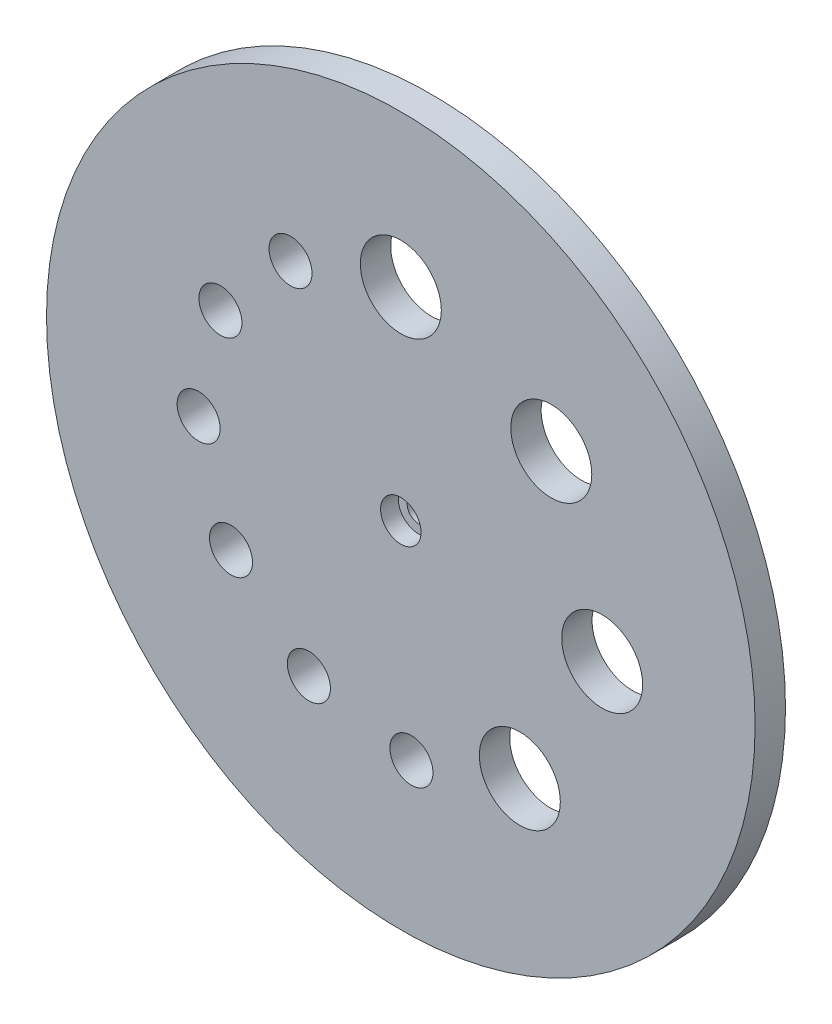
ISO-10303-21;
HEADER;
FILE_DESCRIPTION(('STEP AP214'),'2;1');
FILE_NAME('part.step','',(''),(''),'','','');
FILE_SCHEMA(('AUTOMOTIVE_DESIGN { 1 0 10303 214 1 1 1 1 }'));
ENDSEC;
DATA;
#1=APPLICATION_CONTEXT('core data for automotive mechanical design processes');
#2=APPLICATION_PROTOCOL_DEFINITION('international standard','automotive_design',2000,#1);
#3=PRODUCT_CONTEXT('',#1,'mechanical');
#4=PRODUCT('Part','Part','',(#3));
#5=PRODUCT_RELATED_PRODUCT_CATEGORY('part','',(#4));
#6=PRODUCT_DEFINITION_FORMATION('','',#4);
#7=PRODUCT_DEFINITION_CONTEXT('part definition',#1,'design');
#8=PRODUCT_DEFINITION('design','',#6,#7);
#9=PRODUCT_DEFINITION_SHAPE('','',#8);
#10=(LENGTH_UNIT() NAMED_UNIT(*) SI_UNIT(.MILLI.,.METRE.));
#11=(NAMED_UNIT(*) PLANE_ANGLE_UNIT() SI_UNIT($,.RADIAN.));
#12=(NAMED_UNIT(*) SI_UNIT($,.STERADIAN.) SOLID_ANGLE_UNIT());
#13=UNCERTAINTY_MEASURE_WITH_UNIT(LENGTH_MEASURE(1.E-05),#10,'distance_accuracy_value','');
#14=(GEOMETRIC_REPRESENTATION_CONTEXT(3) GLOBAL_UNCERTAINTY_ASSIGNED_CONTEXT((#13)) GLOBAL_UNIT_ASSIGNED_CONTEXT((#10,
#11,#12)) REPRESENTATION_CONTEXT('',''));
#15=CARTESIAN_POINT('',(0.,0.,0.));
#16=DIRECTION('',(0.,0.,1.));
#17=DIRECTION('',(1.,0.,0.));
#18=AXIS2_PLACEMENT_3D('',#15,#16,#17);
#19=CARTESIAN_POINT('',(0.,0.,12.));
#20=DIRECTION('',(0.,0.,-1.));
#21=DIRECTION('',(-1.,0.,0.));
#22=AXIS2_PLACEMENT_3D('',#19,#20,#21);
#23=CYLINDRICAL_SURFACE('',#22,140.);
#24=CARTESIAN_POINT('',(0.,0.,12.));
#25=DIRECTION('',(0.,0.,1.));
#26=DIRECTION('',(1.,0.,0.));
#27=AXIS2_PLACEMENT_3D('',#24,#25,#26);
#28=CIRCLE('',#27,140.);
#29=CARTESIAN_POINT('',(140.,0.,12.));
#30=VERTEX_POINT('',#29);
#31=EDGE_CURVE('E10',#30,#30,#28,.T.);
#32=ORIENTED_EDGE('',*,*,#31,.F.);
#33=EDGE_LOOP('',(#32));
#34=FACE_BOUND('',#33,.T.);
#35=CARTESIAN_POINT('',(0.,0.,0.));
#36=DIRECTION('',(0.,0.,1.));
#37=DIRECTION('',(1.,0.,0.));
#38=AXIS2_PLACEMENT_3D('',#35,#36,#37);
#39=CIRCLE('',#38,140.);
#40=CARTESIAN_POINT('',(140.,0.,0.));
#41=VERTEX_POINT('',#40);
#42=EDGE_CURVE('E32',#41,#41,#39,.T.);
#43=ORIENTED_EDGE('',*,*,#42,.T.);
#44=EDGE_LOOP('',(#43));
#45=FACE_BOUND('',#44,.T.);
#46=ADVANCED_FACE('F29',(#34,#45),#23,.T.);
#47=CARTESIAN_POINT('',(0.,0.,12.));
#48=DIRECTION('',(0.,0.,1.));
#49=DIRECTION('',(1.,0.,0.));
#50=AXIS2_PLACEMENT_3D('',#47,#48,#49);
#51=PLANE('',#50);
#52=CARTESIAN_POINT('',(0.,0.,12.));
#53=DIRECTION('',(0.,0.,1.));
#54=DIRECTION('',(1.,0.,0.));
#55=AXIS2_PLACEMENT_3D('',#52,#53,#54);
#56=CIRCLE('',#55,8.);
#57=CARTESIAN_POINT('',(8.,0.,12.));
#58=VERTEX_POINT('',#57);
#59=EDGE_CURVE('E109',#58,#58,#56,.T.);
#60=ORIENTED_EDGE('',*,*,#59,.F.);
#61=EDGE_LOOP('',(#60));
#62=FACE_BOUND('',#61,.T.);
#63=CARTESIAN_POINT('',(-43.5711228012014,67.0936454356344,12.));
#64=DIRECTION('',(0.,0.,1.));
#65=DIRECTION('',(1.,0.,0.));
#66=AXIS2_PLACEMENT_3D('',#63,#64,#65);
#67=CIRCLE('',#66,8.50000000000001);
#68=CARTESIAN_POINT('',(-35.0711228012014,67.0936454356344,12.));
#69=VERTEX_POINT('',#68);
#70=EDGE_CURVE('E95',#69,#69,#67,.T.);
#71=ORIENTED_EDGE('',*,*,#70,.F.);
#72=EDGE_LOOP('',(#71));
#73=FACE_BOUND('',#72,.T.);
#74=CARTESIAN_POINT('',(-71.280521935069,36.3192399791645,12.));
#75=DIRECTION('',(0.,0.,1.));
#76=DIRECTION('',(1.,0.,0.));
#77=AXIS2_PLACEMENT_3D('',#74,#75,#76);
#78=CIRCLE('',#77,8.50000000000001);
#79=CARTESIAN_POINT('',(-62.780521935069,36.3192399791645,12.));
#80=VERTEX_POINT('',#79);
#81=EDGE_CURVE('E89',#80,#80,#78,.T.);
#82=ORIENTED_EDGE('',*,*,#81,.F.);
#83=EDGE_LOOP('',(#82));
#84=FACE_BOUND('',#83,.T.);
#85=CARTESIAN_POINT('',(-79.8903627803659,-4.18687649943474,12.));
#86=DIRECTION('',(0.,0.,1.));
#87=DIRECTION('',(1.,0.,0.));
#88=AXIS2_PLACEMENT_3D('',#85,#86,#87);
#89=CIRCLE('',#88,8.50000000000001);
#90=CARTESIAN_POINT('',(-71.3903627803659,-4.18687649943474,12.));
#91=VERTEX_POINT('',#90);
#92=EDGE_CURVE('E83',#91,#91,#89,.T.);
#93=ORIENTED_EDGE('',*,*,#92,.F.);
#94=EDGE_LOOP('',(#93));
#95=FACE_BOUND('',#94,.T.);
#96=CARTESIAN_POINT('',(-67.0936454356343,-43.5711228012016,12.));
#97=DIRECTION('',(0.,0.,1.));
#98=DIRECTION('',(1.,0.,0.));
#99=AXIS2_PLACEMENT_3D('',#96,#97,#98);
#100=CIRCLE('',#99,8.5);
#101=CARTESIAN_POINT('',(-58.5936454356343,-43.5711228012016,12.));
#102=VERTEX_POINT('',#101);
#103=EDGE_CURVE('E77',#102,#102,#100,.T.);
#104=ORIENTED_EDGE('',*,*,#103,.F.);
#105=EDGE_LOOP('',(#104));
#106=FACE_BOUND('',#105,.T.);
#107=CARTESIAN_POINT('',(-36.3192399791643,-71.2805219350692,12.));
#108=DIRECTION('',(0.,0.,1.));
#109=DIRECTION('',(1.,0.,0.));
#110=AXIS2_PLACEMENT_3D('',#107,#108,#109);
#111=CIRCLE('',#110,8.50000000000001);
#112=CARTESIAN_POINT('',(-27.8192399791642,-71.2805219350692,12.));
#113=VERTEX_POINT('',#112);
#114=EDGE_CURVE('E71',#113,#113,#111,.T.);
#115=ORIENTED_EDGE('',*,*,#114,.F.);
#116=EDGE_LOOP('',(#115));
#117=FACE_BOUND('',#116,.T.);
#118=CARTESIAN_POINT('',(47.0228201833975,-64.7213595499961,12.));
#119=DIRECTION('',(0.,0.,1.));
#120=DIRECTION('',(1.,0.,0.));
#121=AXIS2_PLACEMENT_3D('',#118,#119,#120);
#122=CIRCLE('',#121,16.);
#123=CARTESIAN_POINT('',(63.0228201833975,-64.7213595499961,12.));
#124=VERTEX_POINT('',#123);
#125=EDGE_CURVE('E65',#124,#124,#122,.T.);
#126=ORIENTED_EDGE('',*,*,#125,.F.);
#127=EDGE_LOOP('',(#126));
#128=FACE_BOUND('',#127,.T.);
#129=CARTESIAN_POINT('',(79.5617516294619,-8.36227706141259,12.));
#130=DIRECTION('',(0.,0.,1.));
#131=DIRECTION('',(1.,0.,0.));
#132=AXIS2_PLACEMENT_3D('',#129,#130,#131);
#133=CIRCLE('',#132,16.);
#134=CARTESIAN_POINT('',(95.5617516294619,-8.36227706141259,12.));
#135=VERTEX_POINT('',#134);
#136=EDGE_CURVE('E59',#135,#135,#133,.T.);
#137=ORIENTED_EDGE('',*,*,#136,.F.);
#138=EDGE_LOOP('',(#137));
#139=FACE_BOUND('',#138,.T.);
#140=CARTESIAN_POINT('',(4.18687649943502,-79.8903627803659,12.));
#141=DIRECTION('',(0.,0.,1.));
#142=DIRECTION('',(1.,0.,0.));
#143=AXIS2_PLACEMENT_3D('',#140,#141,#142);
#144=CIRCLE('',#143,8.5);
#145=CARTESIAN_POINT('',(12.686876499435,-79.8903627803659,12.));
#146=VERTEX_POINT('',#145);
#147=EDGE_CURVE('E53',#146,#146,#144,.T.);
#148=ORIENTED_EDGE('',*,*,#147,.F.);
#149=EDGE_LOOP('',(#148));
#150=FACE_BOUND('',#149,.T.);
#151=CARTESIAN_POINT('',(0.,80.,12.));
#152=DIRECTION('',(0.,0.,1.));
#153=DIRECTION('',(1.,0.,0.));
#154=AXIS2_PLACEMENT_3D('',#151,#152,#153);
#155=CIRCLE('',#154,16.);
#156=CARTESIAN_POINT('',(16.,80.,12.));
#157=VERTEX_POINT('',#156);
#158=EDGE_CURVE('E47',#157,#157,#155,.T.);
#159=ORIENTED_EDGE('',*,*,#158,.F.);
#160=EDGE_LOOP('',(#159));
#161=FACE_BOUND('',#160,.T.);
#162=CARTESIAN_POINT('',(59.4515860381916,53.5304485087086,12.));
#163=DIRECTION('',(0.,0.,1.));
#164=DIRECTION('',(1.,0.,0.));
#165=AXIS2_PLACEMENT_3D('',#162,#163,#164);
#166=CIRCLE('',#165,16.);
#167=CARTESIAN_POINT('',(75.4515860381916,53.5304485087086,12.));
#168=VERTEX_POINT('',#167);
#169=EDGE_CURVE('E41',#168,#168,#166,.T.);
#170=ORIENTED_EDGE('',*,*,#169,.F.);
#171=EDGE_LOOP('',(#170));
#172=FACE_BOUND('',#171,.T.);
#173=ORIENTED_EDGE('',*,*,#31,.T.);
#174=EDGE_LOOP('',(#173));
#175=FACE_BOUND('',#174,.T.);
#176=ADVANCED_FACE('F115',(#62,#73,#84,#95,#106,#117,#128,#139,#150,#161,#172,#175),#51,.T.);
#177=CARTESIAN_POINT('',(0.,0.,0.));
#178=DIRECTION('',(0.,0.,1.));
#179=DIRECTION('',(1.,0.,0.));
#180=AXIS2_PLACEMENT_3D('',#177,#178,#179);
#181=PLANE('',#180);
#182=CARTESIAN_POINT('',(0.,0.,0.));
#183=DIRECTION('',(0.,0.,1.));
#184=DIRECTION('',(1.,0.,0.));
#185=AXIS2_PLACEMENT_3D('',#182,#183,#184);
#186=CIRCLE('',#185,4.5);
#187=CARTESIAN_POINT('',(4.5,0.,0.));
#188=VERTEX_POINT('',#187);
#189=EDGE_CURVE('E98',#188,#188,#186,.T.);
#190=ORIENTED_EDGE('',*,*,#189,.T.);
#191=EDGE_LOOP('',(#190));
#192=FACE_BOUND('',#191,.T.);
#193=CARTESIAN_POINT('',(-43.5711228012014,67.0936454356344,0.));
#194=DIRECTION('',(0.,0.,1.));
#195=DIRECTION('',(1.,0.,0.));
#196=AXIS2_PLACEMENT_3D('',#193,#194,#195);
#197=CIRCLE('',#196,8.50000000000001);
#198=CARTESIAN_POINT('',(-35.0711228012014,67.0936454356344,0.));
#199=VERTEX_POINT('',#198);
#200=EDGE_CURVE('E92',#199,#199,#197,.T.);
#201=ORIENTED_EDGE('',*,*,#200,.T.);
#202=EDGE_LOOP('',(#201));
#203=FACE_BOUND('',#202,.T.);
#204=CARTESIAN_POINT('',(-71.280521935069,36.3192399791645,0.));
#205=DIRECTION('',(0.,0.,1.));
#206=DIRECTION('',(1.,0.,0.));
#207=AXIS2_PLACEMENT_3D('',#204,#205,#206);
#208=CIRCLE('',#207,8.50000000000001);
#209=CARTESIAN_POINT('',(-62.780521935069,36.3192399791645,0.));
#210=VERTEX_POINT('',#209);
#211=EDGE_CURVE('E86',#210,#210,#208,.T.);
#212=ORIENTED_EDGE('',*,*,#211,.T.);
#213=EDGE_LOOP('',(#212));
#214=FACE_BOUND('',#213,.T.);
#215=CARTESIAN_POINT('',(-79.8903627803659,-4.18687649943474,0.));
#216=DIRECTION('',(0.,0.,1.));
#217=DIRECTION('',(1.,0.,0.));
#218=AXIS2_PLACEMENT_3D('',#215,#216,#217);
#219=CIRCLE('',#218,8.50000000000001);
#220=CARTESIAN_POINT('',(-71.3903627803659,-4.18687649943474,0.));
#221=VERTEX_POINT('',#220);
#222=EDGE_CURVE('E80',#221,#221,#219,.T.);
#223=ORIENTED_EDGE('',*,*,#222,.T.);
#224=EDGE_LOOP('',(#223));
#225=FACE_BOUND('',#224,.T.);
#226=CARTESIAN_POINT('',(-67.0936454356343,-43.5711228012016,0.));
#227=DIRECTION('',(0.,0.,1.));
#228=DIRECTION('',(1.,0.,0.));
#229=AXIS2_PLACEMENT_3D('',#226,#227,#228);
#230=CIRCLE('',#229,8.5);
#231=CARTESIAN_POINT('',(-58.5936454356343,-43.5711228012016,0.));
#232=VERTEX_POINT('',#231);
#233=EDGE_CURVE('E74',#232,#232,#230,.T.);
#234=ORIENTED_EDGE('',*,*,#233,.T.);
#235=EDGE_LOOP('',(#234));
#236=FACE_BOUND('',#235,.T.);
#237=CARTESIAN_POINT('',(-36.3192399791643,-71.2805219350692,0.));
#238=DIRECTION('',(0.,0.,1.));
#239=DIRECTION('',(1.,0.,0.));
#240=AXIS2_PLACEMENT_3D('',#237,#238,#239);
#241=CIRCLE('',#240,8.50000000000001);
#242=CARTESIAN_POINT('',(-27.8192399791642,-71.2805219350692,0.));
#243=VERTEX_POINT('',#242);
#244=EDGE_CURVE('E68',#243,#243,#241,.T.);
#245=ORIENTED_EDGE('',*,*,#244,.T.);
#246=EDGE_LOOP('',(#245));
#247=FACE_BOUND('',#246,.T.);
#248=CARTESIAN_POINT('',(47.0228201833975,-64.7213595499961,0.));
#249=DIRECTION('',(0.,0.,1.));
#250=DIRECTION('',(1.,0.,0.));
#251=AXIS2_PLACEMENT_3D('',#248,#249,#250);
#252=CIRCLE('',#251,16.);
#253=CARTESIAN_POINT('',(63.0228201833975,-64.7213595499961,0.));
#254=VERTEX_POINT('',#253);
#255=EDGE_CURVE('E62',#254,#254,#252,.T.);
#256=ORIENTED_EDGE('',*,*,#255,.T.);
#257=EDGE_LOOP('',(#256));
#258=FACE_BOUND('',#257,.T.);
#259=CARTESIAN_POINT('',(79.5617516294619,-8.36227706141259,0.));
#260=DIRECTION('',(0.,0.,1.));
#261=DIRECTION('',(1.,0.,0.));
#262=AXIS2_PLACEMENT_3D('',#259,#260,#261);
#263=CIRCLE('',#262,16.);
#264=CARTESIAN_POINT('',(95.5617516294619,-8.36227706141259,0.));
#265=VERTEX_POINT('',#264);
#266=EDGE_CURVE('E56',#265,#265,#263,.T.);
#267=ORIENTED_EDGE('',*,*,#266,.T.);
#268=EDGE_LOOP('',(#267));
#269=FACE_BOUND('',#268,.T.);
#270=CARTESIAN_POINT('',(4.18687649943502,-79.8903627803659,0.));
#271=DIRECTION('',(0.,0.,1.));
#272=DIRECTION('',(1.,0.,0.));
#273=AXIS2_PLACEMENT_3D('',#270,#271,#272);
#274=CIRCLE('',#273,8.5);
#275=CARTESIAN_POINT('',(12.686876499435,-79.8903627803659,0.));
#276=VERTEX_POINT('',#275);
#277=EDGE_CURVE('E50',#276,#276,#274,.T.);
#278=ORIENTED_EDGE('',*,*,#277,.T.);
#279=EDGE_LOOP('',(#278));
#280=FACE_BOUND('',#279,.T.);
#281=CARTESIAN_POINT('',(0.,80.,0.));
#282=DIRECTION('',(0.,0.,1.));
#283=DIRECTION('',(1.,0.,0.));
#284=AXIS2_PLACEMENT_3D('',#281,#282,#283);
#285=CIRCLE('',#284,16.);
#286=CARTESIAN_POINT('',(16.,80.,0.));
#287=VERTEX_POINT('',#286);
#288=EDGE_CURVE('E44',#287,#287,#285,.T.);
#289=ORIENTED_EDGE('',*,*,#288,.T.);
#290=EDGE_LOOP('',(#289));
#291=FACE_BOUND('',#290,.T.);
#292=CARTESIAN_POINT('',(59.4515860381916,53.5304485087086,0.));
#293=DIRECTION('',(0.,0.,1.));
#294=DIRECTION('',(1.,0.,0.));
#295=AXIS2_PLACEMENT_3D('',#292,#293,#294);
#296=CIRCLE('',#295,16.);
#297=CARTESIAN_POINT('',(75.4515860381916,53.5304485087086,0.));
#298=VERTEX_POINT('',#297);
#299=EDGE_CURVE('E39',#298,#298,#296,.T.);
#300=ORIENTED_EDGE('',*,*,#299,.T.);
#301=EDGE_LOOP('',(#300));
#302=FACE_BOUND('',#301,.T.);
#303=ORIENTED_EDGE('',*,*,#42,.F.);
#304=EDGE_LOOP('',(#303));
#305=FACE_BOUND('',#304,.T.);
#306=ADVANCED_FACE('F118',(#192,#203,#214,#225,#236,#247,#258,#269,#280,#291,#302,#305),#181,.F.);
#307=CARTESIAN_POINT('',(59.4515860381916,53.5304485087086,0.));
#308=DIRECTION('',(0.,0.,1.));
#309=DIRECTION('',(1.,0.,0.));
#310=AXIS2_PLACEMENT_3D('',#307,#308,#309);
#311=CYLINDRICAL_SURFACE('',#310,16.);
#312=ORIENTED_EDGE('',*,*,#299,.F.);
#313=EDGE_LOOP('',(#312));
#314=FACE_BOUND('',#313,.T.);
#315=ORIENTED_EDGE('',*,*,#169,.T.);
#316=EDGE_LOOP('',(#315));
#317=FACE_BOUND('',#316,.T.);
#318=ADVANCED_FACE('F140',(#314,#317),#311,.F.);
#319=CARTESIAN_POINT('',(0.,80.,0.));
#320=DIRECTION('',(0.,0.,1.));
#321=DIRECTION('',(1.,0.,0.));
#322=AXIS2_PLACEMENT_3D('',#319,#320,#321);
#323=CYLINDRICAL_SURFACE('',#322,16.);
#324=ORIENTED_EDGE('',*,*,#288,.F.);
#325=EDGE_LOOP('',(#324));
#326=FACE_BOUND('',#325,.T.);
#327=ORIENTED_EDGE('',*,*,#158,.T.);
#328=EDGE_LOOP('',(#327));
#329=FACE_BOUND('',#328,.T.);
#330=ADVANCED_FACE('F142',(#326,#329),#323,.F.);
#331=CARTESIAN_POINT('',(4.18687649943502,-79.8903627803659,0.));
#332=DIRECTION('',(0.,0.,1.));
#333=DIRECTION('',(1.,0.,0.));
#334=AXIS2_PLACEMENT_3D('',#331,#332,#333);
#335=CYLINDRICAL_SURFACE('',#334,8.5);
#336=ORIENTED_EDGE('',*,*,#277,.F.);
#337=EDGE_LOOP('',(#336));
#338=FACE_BOUND('',#337,.T.);
#339=ORIENTED_EDGE('',*,*,#147,.T.);
#340=EDGE_LOOP('',(#339));
#341=FACE_BOUND('',#340,.T.);
#342=ADVANCED_FACE('F149',(#338,#341),#335,.F.);
#343=CARTESIAN_POINT('',(79.5617516294619,-8.36227706141259,0.));
#344=DIRECTION('',(0.,0.,1.));
#345=DIRECTION('',(1.,0.,0.));
#346=AXIS2_PLACEMENT_3D('',#343,#344,#345);
#347=CYLINDRICAL_SURFACE('',#346,16.);
#348=ORIENTED_EDGE('',*,*,#266,.F.);
#349=EDGE_LOOP('',(#348));
#350=FACE_BOUND('',#349,.T.);
#351=ORIENTED_EDGE('',*,*,#136,.T.);
#352=EDGE_LOOP('',(#351));
#353=FACE_BOUND('',#352,.T.);
#354=ADVANCED_FACE('F230',(#350,#353),#347,.F.);
#355=CARTESIAN_POINT('',(47.0228201833975,-64.7213595499961,0.));
#356=DIRECTION('',(0.,0.,1.));
#357=DIRECTION('',(1.,0.,0.));
#358=AXIS2_PLACEMENT_3D('',#355,#356,#357);
#359=CYLINDRICAL_SURFACE('',#358,16.);
#360=ORIENTED_EDGE('',*,*,#255,.F.);
#361=EDGE_LOOP('',(#360));
#362=FACE_BOUND('',#361,.T.);
#363=ORIENTED_EDGE('',*,*,#125,.T.);
#364=EDGE_LOOP('',(#363));
#365=FACE_BOUND('',#364,.T.);
#366=ADVANCED_FACE('F226',(#362,#365),#359,.F.);
#367=CARTESIAN_POINT('',(-36.3192399791643,-71.2805219350692,0.));
#368=DIRECTION('',(0.,0.,1.));
#369=DIRECTION('',(1.,0.,0.));
#370=AXIS2_PLACEMENT_3D('',#367,#368,#369);
#371=CYLINDRICAL_SURFACE('',#370,8.50000000000001);
#372=ORIENTED_EDGE('',*,*,#244,.F.);
#373=EDGE_LOOP('',(#372));
#374=FACE_BOUND('',#373,.T.);
#375=ORIENTED_EDGE('',*,*,#114,.T.);
#376=EDGE_LOOP('',(#375));
#377=FACE_BOUND('',#376,.T.);
#378=ADVANCED_FACE('F222',(#374,#377),#371,.F.);
#379=CARTESIAN_POINT('',(-67.0936454356343,-43.5711228012016,0.));
#380=DIRECTION('',(0.,0.,1.));
#381=DIRECTION('',(1.,0.,0.));
#382=AXIS2_PLACEMENT_3D('',#379,#380,#381);
#383=CYLINDRICAL_SURFACE('',#382,8.5);
#384=ORIENTED_EDGE('',*,*,#233,.F.);
#385=EDGE_LOOP('',(#384));
#386=FACE_BOUND('',#385,.T.);
#387=ORIENTED_EDGE('',*,*,#103,.T.);
#388=EDGE_LOOP('',(#387));
#389=FACE_BOUND('',#388,.T.);
#390=ADVANCED_FACE('F218',(#386,#389),#383,.F.);
#391=CARTESIAN_POINT('',(-79.8903627803659,-4.18687649943474,0.));
#392=DIRECTION('',(0.,0.,1.));
#393=DIRECTION('',(1.,0.,0.));
#394=AXIS2_PLACEMENT_3D('',#391,#392,#393);
#395=CYLINDRICAL_SURFACE('',#394,8.50000000000001);
#396=ORIENTED_EDGE('',*,*,#222,.F.);
#397=EDGE_LOOP('',(#396));
#398=FACE_BOUND('',#397,.T.);
#399=ORIENTED_EDGE('',*,*,#92,.T.);
#400=EDGE_LOOP('',(#399));
#401=FACE_BOUND('',#400,.T.);
#402=ADVANCED_FACE('F214',(#398,#401),#395,.F.);
#403=CARTESIAN_POINT('',(-71.280521935069,36.3192399791645,0.));
#404=DIRECTION('',(0.,0.,1.));
#405=DIRECTION('',(1.,0.,0.));
#406=AXIS2_PLACEMENT_3D('',#403,#404,#405);
#407=CYLINDRICAL_SURFACE('',#406,8.50000000000001);
#408=ORIENTED_EDGE('',*,*,#211,.F.);
#409=EDGE_LOOP('',(#408));
#410=FACE_BOUND('',#409,.T.);
#411=ORIENTED_EDGE('',*,*,#81,.T.);
#412=EDGE_LOOP('',(#411));
#413=FACE_BOUND('',#412,.T.);
#414=ADVANCED_FACE('F210',(#410,#413),#407,.F.);
#415=CARTESIAN_POINT('',(-43.5711228012014,67.0936454356344,0.));
#416=DIRECTION('',(0.,0.,1.));
#417=DIRECTION('',(1.,0.,0.));
#418=AXIS2_PLACEMENT_3D('',#415,#416,#417);
#419=CYLINDRICAL_SURFACE('',#418,8.50000000000001);
#420=ORIENTED_EDGE('',*,*,#200,.F.);
#421=EDGE_LOOP('',(#420));
#422=FACE_BOUND('',#421,.T.);
#423=ORIENTED_EDGE('',*,*,#70,.T.);
#424=EDGE_LOOP('',(#423));
#425=FACE_BOUND('',#424,.T.);
#426=ADVANCED_FACE('F182',(#422,#425),#419,.F.);
#427=CARTESIAN_POINT('',(0.,0.,12.));
#428=DIRECTION('',(0.,0.,1.));
#429=DIRECTION('',(1.,0.,0.));
#430=AXIS2_PLACEMENT_3D('',#427,#428,#429);
#431=CYLINDRICAL_SURFACE('',#430,4.5);
#432=ORIENTED_EDGE('',*,*,#189,.F.);
#433=EDGE_LOOP('',(#432));
#434=FACE_BOUND('',#433,.T.);
#435=CARTESIAN_POINT('',(0.,0.,5.));
#436=DIRECTION('',(0.,0.,1.));
#437=DIRECTION('',(1.,0.,0.));
#438=AXIS2_PLACEMENT_3D('',#435,#436,#437);
#439=CIRCLE('',#438,4.5);
#440=CARTESIAN_POINT('',(4.5,0.,5.));
#441=VERTEX_POINT('',#440);
#442=EDGE_CURVE('E103',#441,#441,#439,.T.);
#443=ORIENTED_EDGE('',*,*,#442,.T.);
#444=EDGE_LOOP('',(#443));
#445=FACE_BOUND('',#444,.T.);
#446=ADVANCED_FACE('F176',(#434,#445),#431,.F.);
#447=CARTESIAN_POINT('',(4.5,0.,5.));
#448=DIRECTION('',(0.,0.,-1.));
#449=DIRECTION('',(-1.,0.,0.));
#450=AXIS2_PLACEMENT_3D('',#447,#448,#449);
#451=PLANE('',#450);
#452=ORIENTED_EDGE('',*,*,#442,.F.);
#453=EDGE_LOOP('',(#452));
#454=FACE_BOUND('',#453,.T.);
#455=CARTESIAN_POINT('',(0.,0.,5.));
#456=DIRECTION('',(0.,0.,1.));
#457=DIRECTION('',(1.,0.,0.));
#458=AXIS2_PLACEMENT_3D('',#455,#456,#457);
#459=CIRCLE('',#458,8.);
#460=CARTESIAN_POINT('',(8.,0.,5.));
#461=VERTEX_POINT('',#460);
#462=EDGE_CURVE('E106',#461,#461,#459,.T.);
#463=ORIENTED_EDGE('',*,*,#462,.T.);
#464=EDGE_LOOP('',(#463));
#465=FACE_BOUND('',#464,.T.);
#466=ADVANCED_FACE('F181',(#454,#465),#451,.F.);
#467=CARTESIAN_POINT('',(0.,0.,12.));
#468=DIRECTION('',(0.,0.,1.));
#469=DIRECTION('',(1.,0.,0.));
#470=AXIS2_PLACEMENT_3D('',#467,#468,#469);
#471=CYLINDRICAL_SURFACE('',#470,8.);
#472=ORIENTED_EDGE('',*,*,#462,.F.);
#473=EDGE_LOOP('',(#472));
#474=FACE_BOUND('',#473,.T.);
#475=ORIENTED_EDGE('',*,*,#59,.T.);
#476=EDGE_LOOP('',(#475));
#477=FACE_BOUND('',#476,.T.);
#478=ADVANCED_FACE('F113',(#474,#477),#471,.F.);
#479=CLOSED_SHELL('',(#46,#176,#306,#318,#330,#342,#354,#366,#378,#390,#402,#414,#426,#446,#466,#478));
#480=MANIFOLD_SOLID_BREP('B2',#479);
#481=ADVANCED_BREP_SHAPE_REPRESENTATION('',(#18,#480),#14);
#482=SHAPE_DEFINITION_REPRESENTATION(#9,#481);
ENDSEC;
END-ISO-10303-21;
